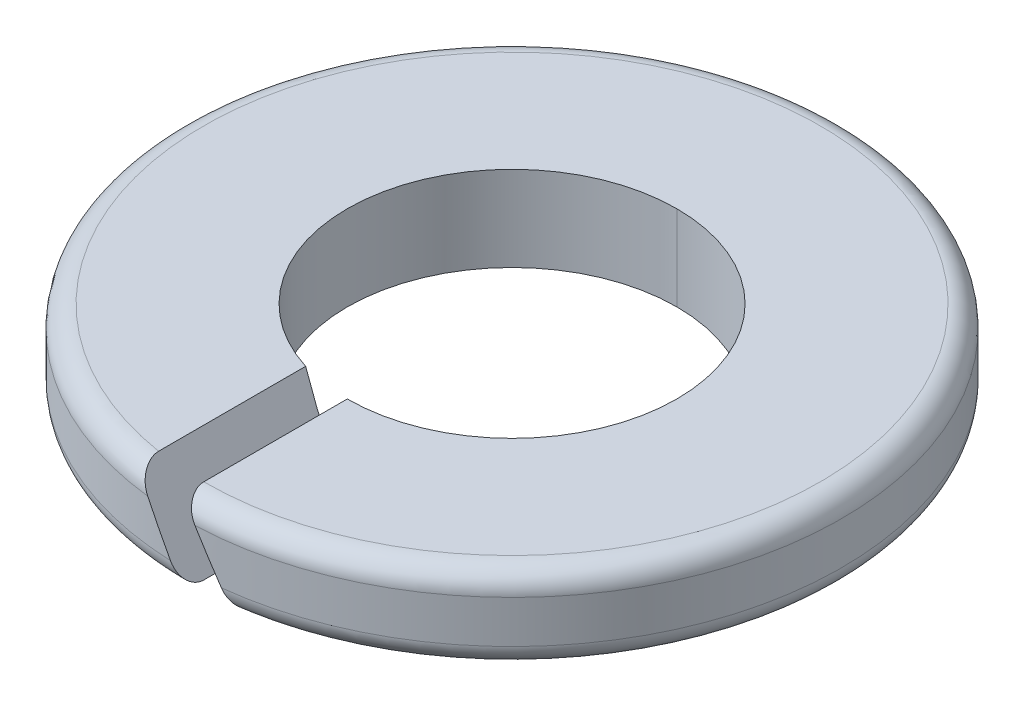
ISO-10303-21;
HEADER;
FILE_DESCRIPTION(('STEP AP214'),'2;1');
FILE_NAME('part.step','',(''),(''),'','','');
FILE_SCHEMA(('AUTOMOTIVE_DESIGN { 1 0 10303 214 1 1 1 1 }'));
ENDSEC;
DATA;
#1=APPLICATION_CONTEXT('core data for automotive mechanical design processes');
#2=APPLICATION_PROTOCOL_DEFINITION('international standard','automotive_design',2000,#1);
#3=PRODUCT_CONTEXT('',#1,'mechanical');
#4=PRODUCT('Part','Part','',(#3));
#5=PRODUCT_RELATED_PRODUCT_CATEGORY('part','',(#4));
#6=PRODUCT_DEFINITION_FORMATION('','',#4);
#7=PRODUCT_DEFINITION_CONTEXT('part definition',#1,'design');
#8=PRODUCT_DEFINITION('design','',#6,#7);
#9=PRODUCT_DEFINITION_SHAPE('','',#8);
#10=(LENGTH_UNIT() NAMED_UNIT(*) SI_UNIT(.MILLI.,.METRE.));
#11=(NAMED_UNIT(*) PLANE_ANGLE_UNIT() SI_UNIT($,.RADIAN.));
#12=(NAMED_UNIT(*) SI_UNIT($,.STERADIAN.) SOLID_ANGLE_UNIT());
#13=UNCERTAINTY_MEASURE_WITH_UNIT(LENGTH_MEASURE(1.E-05),#10,'distance_accuracy_value','');
#14=(GEOMETRIC_REPRESENTATION_CONTEXT(3) GLOBAL_UNCERTAINTY_ASSIGNED_CONTEXT((#13)) GLOBAL_UNIT_ASSIGNED_CONTEXT((#10,
#11,#12)) REPRESENTATION_CONTEXT('',''));
#15=CARTESIAN_POINT('',(0.,0.,0.));
#16=DIRECTION('',(0.,0.,1.));
#17=DIRECTION('',(1.,0.,0.));
#18=AXIS2_PLACEMENT_3D('',#15,#16,#17);
#19=CARTESIAN_POINT('',(0.,0.6,0.));
#20=DIRECTION('',(0.,1.,0.));
#21=DIRECTION('',(0.,0.,1.));
#22=AXIS2_PLACEMENT_3D('',#19,#20,#21);
#23=TOROIDAL_SURFACE('',#22,2.9,0.2);
#24=CARTESIAN_POINT('',(0.115456732515857,0.6,3.09784921242412));
#25=CARTESIAN_POINT('',(0.0704354723741685,0.677988107164708,3.09952715322539));
#26=CARTESIAN_POINT('',(0.0368030310384559,0.73624792554486,3.04618978642237));
#27=CARTESIAN_POINT('',(0.020113865166,0.76515774398296,3.01972259800479));
#28=CARTESIAN_POINT('',(0.0100766260419106,0.782544757984428,2.9812014846878));
#29=CARTESIAN_POINT('',(0.,0.799999999999912,2.94252921148453));
#30=CARTESIAN_POINT('',(0.,0.799999999999912,2.9));
#31=B_SPLINE_CURVE_WITH_KNOTS('',2,(#24,#25,#26,#27,#28,#29,#30),.UNSPECIFIED.,.F.,.F.,(3,2,2,
3),(0.,0.5,0.75,1.),.UNSPECIFIED.);
#32=CARTESIAN_POINT('',(0.115456732515857,0.6,3.09784921242413));
#33=VERTEX_POINT('',#32);
#34=CARTESIAN_POINT('',(0.,0.799999999999912,2.9));
#35=VERTEX_POINT('',#34);
#36=EDGE_CURVE('E41',#33,#35,#31,.T.);
#37=ORIENTED_EDGE('',*,*,#36,.F.);
#38=CARTESIAN_POINT('',(0.,0.6,0.));
#39=DIRECTION('',(0.,-1.,0.));
#40=DIRECTION('',(0.,0.,1.));
#41=AXIS2_PLACEMENT_3D('',#38,#39,#40);
#42=CIRCLE('',#41,3.1);
#43=CARTESIAN_POINT('',(0.,0.6,-3.1));
#44=VERTEX_POINT('',#43);
#45=EDGE_CURVE('E333',#44,#33,#42,.T.);
#46=ORIENTED_EDGE('',*,*,#45,.F.);
#47=CARTESIAN_POINT('',(0.,0.6,0.));
#48=DIRECTION('',(0.,-1.,0.));
#49=DIRECTION('',(0.,0.,1.));
#50=AXIS2_PLACEMENT_3D('',#47,#48,#49);
#51=CIRCLE('',#50,3.1);
#52=CARTESIAN_POINT('',(-0.346370197547841,0.6,3.08058885381524));
#53=VERTEX_POINT('',#52);
#54=EDGE_CURVE('E147',#53,#44,#51,.T.);
#55=ORIENTED_EDGE('',*,*,#54,.F.);
#56=CARTESIAN_POINT('',(-0.461826930063803,0.800000000000022,2.86299072416727));
#57=CARTESIAN_POINT('',(-0.461826930063803,0.800000000000022,2.90535657537502));
#58=CARTESIAN_POINT('',(-0.451763929212738,0.78256836023025,2.94690126208168));
#59=CARTESIAN_POINT('',(-0.44251560680724,0.766547947727721,2.98508258220528));
#60=CARTESIAN_POINT('',(-0.425513024406954,0.737095213305435,3.01574766091442));
#61=CARTESIAN_POINT('',(-0.409817805663643,0.709907160428323,3.04405483842368));
#62=CARTESIAN_POINT('',(-0.388795240661043,0.673490808528365,3.06141017979444));
#63=CARTESIAN_POINT('',(-0.368590326196873,0.638490832305447,3.07809050342999));
#64=CARTESIAN_POINT('',(-0.346370197547842,0.6,3.08058885381524));
#65=B_SPLINE_CURVE_WITH_KNOTS('',2,(#56,#57,#58,#59,#60,#61,#62,#63,#64),.UNSPECIFIED.,.F.,.F.,
(3,2,2,2,3),(0.,0.25,0.5,0.75,1.),.UNSPECIFIED.);
#66=CARTESIAN_POINT('',(-0.461826930063802,0.800000000000023,2.86299072416727));
#67=VERTEX_POINT('',#66);
#68=EDGE_CURVE('E11',#67,#53,#65,.T.);
#69=ORIENTED_EDGE('',*,*,#68,.F.);
#70=CARTESIAN_POINT('',(0.,0.8,0.));
#71=DIRECTION('',(0.,1.,0.));
#72=DIRECTION('',(0.,0.,1.));
#73=AXIS2_PLACEMENT_3D('',#70,#71,#72);
#74=CIRCLE('',#73,2.9);
#75=EDGE_CURVE('E120',#35,#67,#74,.T.);
#76=ORIENTED_EDGE('',*,*,#75,.F.);
#77=EDGE_LOOP('',(#37,#46,#55,#69,#76));
#78=FACE_BOUND('',#77,.T.);
#79=ADVANCED_FACE('F17',(#78),#23,.T.);
#80=CARTESIAN_POINT('',(0.,0.2,0.));
#81=DIRECTION('',(0.,1.,0.));
#82=DIRECTION('',(0.,0.,1.));
#83=AXIS2_PLACEMENT_3D('',#80,#81,#82);
#84=TOROIDAL_SURFACE('',#83,2.9,0.2);
#85=CARTESIAN_POINT('',(0.,0.2,-2.9));
#86=DIRECTION('',(1.,0.,0.));
#87=DIRECTION('',(0.,0.,-1.));
#88=AXIS2_PLACEMENT_3D('',#85,#86,#87);
#89=CIRCLE('',#88,0.2);
#90=CARTESIAN_POINT('',(0.,0.,-2.9));
#91=VERTEX_POINT('',#90);
#92=CARTESIAN_POINT('',(0.,0.2,-3.1));
#93=VERTEX_POINT('',#92);
#94=EDGE_CURVE('E289',#91,#93,#89,.T.);
#95=ORIENTED_EDGE('',*,*,#94,.F.);
#96=CARTESIAN_POINT('',(0.,0.,0.));
#97=DIRECTION('',(0.,-1.,0.));
#98=DIRECTION('',(0.,0.,1.));
#99=AXIS2_PLACEMENT_3D('',#96,#97,#98);
#100=CIRCLE('',#99,2.9);
#101=CARTESIAN_POINT('',(0.,0.,2.9));
#102=VERTEX_POINT('',#101);
#103=EDGE_CURVE('E209',#102,#91,#100,.T.);
#104=ORIENTED_EDGE('',*,*,#103,.F.);
#105=CARTESIAN_POINT('',(-0.11545673251595,0.200000000000004,3.09784921242412));
#106=CARTESIAN_POINT('',(-0.0704354723742432,0.122011892835291,3.09952715322539));
#107=CARTESIAN_POINT('',(-0.0368030310385194,0.0637520744551402,3.04618978642237));
#108=CARTESIAN_POINT('',(-0.0201138651660494,0.0348422560170256,3.01972259800477));
#109=CARTESIAN_POINT('',(-0.0100766260419584,0.0174552420155603,2.9812014846878));
#110=CARTESIAN_POINT('',(0.,0.,2.94252921148436));
#111=CARTESIAN_POINT('',(0.,0.,2.9));
#112=B_SPLINE_CURVE_WITH_KNOTS('',2,(#105,#106,#107,#108,#109,#110,#111),.UNSPECIFIED.,.F.,.F.,
(3,2,2,3),(0.,0.5,0.75,1.),.UNSPECIFIED.);
#113=CARTESIAN_POINT('',(-0.11545673251595,0.200000000000005,3.09784921242412));
#114=VERTEX_POINT('',#113);
#115=EDGE_CURVE('E28',#114,#102,#112,.T.);
#116=ORIENTED_EDGE('',*,*,#115,.F.);
#117=CARTESIAN_POINT('',(0.,0.2,0.));
#118=DIRECTION('',(0.,1.,0.));
#119=DIRECTION('',(0.,0.,1.));
#120=AXIS2_PLACEMENT_3D('',#117,#118,#119);
#121=CIRCLE('',#120,3.1);
#122=EDGE_CURVE('E142',#93,#114,#121,.T.);
#123=ORIENTED_EDGE('',*,*,#122,.F.);
#124=EDGE_LOOP('',(#95,#104,#116,#123));
#125=FACE_BOUND('',#124,.T.);
#126=ADVANCED_FACE('F19',(#125),#84,.T.);
#127=CARTESIAN_POINT('',(0.,0.,3.1));
#128=DIRECTION('',(0.86605038090288,0.499956735866191,0.));
#129=DIRECTION('',(0.,0.,-1.));
#130=AXIS2_PLACEMENT_3D('',#127,#128,#129);
#131=PLANE('',#130);
#132=CARTESIAN_POINT('',(-0.346370197547841,0.6,3.08058885381524));
#133=CARTESIAN_POINT('',(-0.269631931287509,0.467070088355855,3.08921702515045));
#134=CARTESIAN_POINT('',(-0.192624958779882,0.333674710140054,3.09497315531238));
#135=CARTESIAN_POINT('',(-0.11545673251595,0.200000000000005,3.09784921242412));
#136=(BOUNDED_CURVE() B_SPLINE_CURVE(3,(#132,#133,#134,#135),.UNSPECIFIED.,.F.,
.F.) B_SPLINE_CURVE_WITH_KNOTS((4,4),(4.60042286297173,4.67513625737951),
.UNSPECIFIED.) CURVE() GEOMETRIC_REPRESENTATION_ITEM() RATIONAL_B_SPLINE_CURVE((1.,
0.999534879818933,0.999534879818933,1.)) REPRESENTATION_ITEM(''));
#137=EDGE_CURVE('E139',#53,#114,#136,.T.);
#138=ORIENTED_EDGE('',*,*,#137,.T.);
#139=ORIENTED_EDGE('',*,*,#115,.T.);
#140=DIRECTION('',(0.,0.,-1.));
#141=VECTOR('',#140,1.);
#142=CARTESIAN_POINT('',(0.,0.,3.1));
#143=LINE('',#142,#141);
#144=CARTESIAN_POINT('',(0.,0.,1.55));
#145=VERTEX_POINT('',#144);
#146=EDGE_CURVE('E104',#102,#145,#143,.T.);
#147=ORIENTED_EDGE('',*,*,#146,.T.);
#148=CARTESIAN_POINT('',(-0.461826930063802,0.800000000000023,1.47959990763309));
#149=CARTESIAN_POINT('',(-0.312038626680473,0.540529114033906,1.52635327112961));
#150=CARTESIAN_POINT('',(-0.156915304634998,0.271816638520104,1.55));
#151=CARTESIAN_POINT('',(0.,0.,1.55));
#152=(BOUNDED_CURVE() B_SPLINE_CURVE(3,(#148,#149,#150,#151),.UNSPECIFIED.,.F.,
.F.) B_SPLINE_CURVE_WITH_KNOTS((4,4),(4.40984159216447,4.71238898038469),
.UNSPECIFIED.) CURVE() GEOMETRIC_REPRESENTATION_ITEM() RATIONAL_B_SPLINE_CURVE((1.,
0.992386624985624,0.992386624985624,1.)) REPRESENTATION_ITEM(''));
#153=CARTESIAN_POINT('',(-0.461826930063802,0.800000000000023,1.47959990763309));
#154=VERTEX_POINT('',#153);
#155=EDGE_CURVE('E56',#154,#145,#152,.T.);
#156=ORIENTED_EDGE('',*,*,#155,.F.);
#157=DIRECTION('',(0.,0.,-1.));
#158=VECTOR('',#157,1.);
#159=CARTESIAN_POINT('',(-0.461826930063802,0.800000000000023,3.1));
#160=LINE('',#159,#158);
#161=EDGE_CURVE('E101',#67,#154,#160,.T.);
#162=ORIENTED_EDGE('',*,*,#161,.F.);
#163=ORIENTED_EDGE('',*,*,#68,.T.);
#164=EDGE_LOOP('',(#138,#139,#147,#156,#162,#163));
#165=FACE_BOUND('',#164,.T.);
#166=ADVANCED_FACE('F99',(#165),#131,.T.);
#167=CARTESIAN_POINT('',(0.,0.799999999999912,3.1));
#168=DIRECTION('',(-0.866050380902955,-0.499956735866062,0.));
#169=DIRECTION('',(-0.499956735866062,0.866050380902955,0.));
#170=AXIS2_PLACEMENT_3D('',#167,#168,#169);
#171=PLANE('',#170);
#172=DIRECTION('',(0.,0.,-1.));
#173=VECTOR('',#172,1.);
#174=CARTESIAN_POINT('',(0.46182693006358,0.,3.1));
#175=LINE('',#174,#173);
#176=CARTESIAN_POINT('',(0.46182693006358,0.,2.86299072416731));
#177=VERTEX_POINT('',#176);
#178=CARTESIAN_POINT('',(0.46182693006358,0.,1.47959990763316));
#179=VERTEX_POINT('',#178);
#180=EDGE_CURVE('E213',#177,#179,#175,.T.);
#181=ORIENTED_EDGE('',*,*,#180,.F.);
#182=CARTESIAN_POINT('',(0.46182693006358,0.,2.86299072416731));
#183=CARTESIAN_POINT('',(0.46182693006358,0.,2.90535657537506));
#184=CARTESIAN_POINT('',(0.45176392921253,0.0174316397697525,2.9469012620817));
#185=CARTESIAN_POINT('',(0.442515606807055,0.0334520522722469,2.98508258220526));
#186=CARTESIAN_POINT('',(0.425513024406758,0.0629047866945624,3.01574766091444));
#187=CARTESIAN_POINT('',(0.409817805663507,0.0900928395715806,3.04405483842362));
#188=CARTESIAN_POINT('',(0.388795240660859,0.126509191471633,3.06141017979447));
#189=CARTESIAN_POINT('',(0.368590326196744,0.161509167694468,3.07809050343001));
#190=CARTESIAN_POINT('',(0.346370197547672,0.2,3.08058885381526));
#191=B_SPLINE_CURVE_WITH_KNOTS('',2,(#182,#183,#184,#185,#186,#187,#188,#189,#190),
.UNSPECIFIED.,.F.,.F.,(3,2,2,2,3),(0.,0.25,0.5,0.75,1.),.UNSPECIFIED.);
#192=CARTESIAN_POINT('',(0.346370197547672,0.2,3.08058885381526));
#193=VERTEX_POINT('',#192);
#194=EDGE_CURVE('E256',#177,#193,#191,.T.);
#195=ORIENTED_EDGE('',*,*,#194,.T.);
#196=CARTESIAN_POINT('',(0.346370197547672,0.2,3.08058885381526));
#197=CARTESIAN_POINT('',(0.269631931287365,0.332929911644146,3.08921702515046));
#198=CARTESIAN_POINT('',(0.192624958779764,0.466325289859949,3.09497315531239));
#199=CARTESIAN_POINT('',(0.115456732515857,0.6,3.09784921242413));
#200=(BOUNDED_CURVE() B_SPLINE_CURVE(3,(#196,#197,#198,#199),.UNSPECIFIED.,.F.,
.F.) B_SPLINE_CURVE_WITH_KNOTS((4,4),(1.45883020938199,1.53354360378974),
.UNSPECIFIED.) CURVE() GEOMETRIC_REPRESENTATION_ITEM() RATIONAL_B_SPLINE_CURVE((1.,
0.999534879818933,0.999534879818933,1.)) REPRESENTATION_ITEM(''));
#201=EDGE_CURVE('E106',#193,#33,#200,.T.);
#202=ORIENTED_EDGE('',*,*,#201,.T.);
#203=ORIENTED_EDGE('',*,*,#36,.T.);
#204=DIRECTION('',(0.,0.,-1.));
#205=VECTOR('',#204,1.);
#206=CARTESIAN_POINT('',(0.,0.799999999999912,3.1));
#207=LINE('',#206,#205);
#208=CARTESIAN_POINT('',(0.,0.8,1.55));
#209=VERTEX_POINT('',#208);
#210=EDGE_CURVE('E127',#35,#209,#207,.T.);
#211=ORIENTED_EDGE('',*,*,#210,.T.);
#212=CARTESIAN_POINT('',(0.46182693006358,0.,1.47959990763316));
#213=CARTESIAN_POINT('',(0.312038626680306,0.25947088596611,1.52635327112964));
#214=CARTESIAN_POINT('',(0.156915304634894,0.528183361479895,1.55));
#215=CARTESIAN_POINT('',(0.,0.8,1.55));
#216=(BOUNDED_CURVE() B_SPLINE_CURVE(3,(#212,#213,#214,#215),.UNSPECIFIED.,.F.,
.F.) B_SPLINE_CURVE_WITH_KNOTS((4,4),(1.26824893857482,1.57079632679492),
.UNSPECIFIED.) CURVE() GEOMETRIC_REPRESENTATION_ITEM() RATIONAL_B_SPLINE_CURVE((1.,
0.99238662498563,0.99238662498563,1.)) REPRESENTATION_ITEM(''));
#217=EDGE_CURVE('E155',#179,#209,#216,.T.);
#218=ORIENTED_EDGE('',*,*,#217,.F.);
#219=EDGE_LOOP('',(#181,#195,#202,#203,#211,#218));
#220=FACE_BOUND('',#219,.T.);
#221=ADVANCED_FACE('F173',(#220),#171,.T.);
#222=CARTESIAN_POINT('',(0.,0.8,0.));
#223=DIRECTION('',(0.,-1.,0.));
#224=DIRECTION('',(0.,0.,-1.));
#225=AXIS2_PLACEMENT_3D('',#222,#223,#224);
#226=CYLINDRICAL_SURFACE('',#225,1.55);
#227=DIRECTION('',(0.,-1.,0.));
#228=VECTOR('',#227,1.);
#229=CARTESIAN_POINT('',(0.,0.8,-1.55));
#230=LINE('',#229,#228);
#231=CARTESIAN_POINT('',(0.,0.8,-1.55));
#232=VERTEX_POINT('',#231);
#233=CARTESIAN_POINT('',(0.,0.,-1.55));
#234=VERTEX_POINT('',#233);
#235=EDGE_CURVE('E112',#232,#234,#230,.T.);
#236=ORIENTED_EDGE('',*,*,#235,.F.);
#237=CARTESIAN_POINT('',(0.,0.8,0.));
#238=DIRECTION('',(0.,1.,0.));
#239=DIRECTION('',(0.,0.,1.));
#240=AXIS2_PLACEMENT_3D('',#237,#238,#239);
#241=CIRCLE('',#240,1.55);
#242=EDGE_CURVE('E109',#232,#154,#241,.T.);
#243=ORIENTED_EDGE('',*,*,#242,.T.);
#244=ORIENTED_EDGE('',*,*,#155,.T.);
#245=CARTESIAN_POINT('',(0.,0.,0.));
#246=DIRECTION('',(0.,1.,0.));
#247=DIRECTION('',(0.,0.,1.));
#248=AXIS2_PLACEMENT_3D('',#245,#246,#247);
#249=CIRCLE('',#248,1.55);
#250=EDGE_CURVE('E331',#234,#145,#249,.T.);
#251=ORIENTED_EDGE('',*,*,#250,.F.);
#252=EDGE_LOOP('',(#236,#243,#244,#251));
#253=FACE_BOUND('',#252,.T.);
#254=ADVANCED_FACE('F110',(#253),#226,.F.);
#255=CARTESIAN_POINT('',(0.,0.8,0.));
#256=DIRECTION('',(0.,-1.,0.));
#257=DIRECTION('',(0.,0.,-1.));
#258=AXIS2_PLACEMENT_3D('',#255,#256,#257);
#259=CYLINDRICAL_SURFACE('',#258,3.1);
#260=DIRECTION('',(0.,-1.,0.));
#261=VECTOR('',#260,1.);
#262=CARTESIAN_POINT('',(0.,0.8,-3.1));
#263=LINE('',#262,#261);
#264=EDGE_CURVE('E154',#44,#93,#263,.T.);
#265=ORIENTED_EDGE('',*,*,#264,.F.);
#266=ORIENTED_EDGE('',*,*,#45,.T.);
#267=ORIENTED_EDGE('',*,*,#201,.F.);
#268=CARTESIAN_POINT('',(0.,0.2,0.));
#269=DIRECTION('',(0.,1.,0.));
#270=DIRECTION('',(0.,0.,1.));
#271=AXIS2_PLACEMENT_3D('',#268,#269,#270);
#272=CIRCLE('',#271,3.1);
#273=EDGE_CURVE('E293',#193,#93,#272,.T.);
#274=ORIENTED_EDGE('',*,*,#273,.T.);
#275=EDGE_LOOP('',(#265,#266,#267,#274));
#276=FACE_BOUND('',#275,.T.);
#277=ADVANCED_FACE('F497',(#276),#259,.T.);
#278=CARTESIAN_POINT('',(0.,0.,0.));
#279=DIRECTION('',(0.,1.,0.));
#280=DIRECTION('',(1.,0.,0.));
#281=AXIS2_PLACEMENT_3D('',#278,#279,#280);
#282=PLANE('',#281);
#283=ORIENTED_EDGE('',*,*,#146,.F.);
#284=ORIENTED_EDGE('',*,*,#103,.T.);
#285=CARTESIAN_POINT('',(0.,0.,0.));
#286=DIRECTION('',(0.,-1.,0.));
#287=DIRECTION('',(0.,0.,1.));
#288=AXIS2_PLACEMENT_3D('',#285,#286,#287);
#289=CIRCLE('',#288,2.9);
#290=EDGE_CURVE('E294',#91,#177,#289,.T.);
#291=ORIENTED_EDGE('',*,*,#290,.T.);
#292=ORIENTED_EDGE('',*,*,#180,.T.);
#293=CARTESIAN_POINT('',(0.,0.,0.));
#294=DIRECTION('',(0.,1.,0.));
#295=DIRECTION('',(0.,0.,1.));
#296=AXIS2_PLACEMENT_3D('',#293,#294,#295);
#297=CIRCLE('',#296,1.55);
#298=EDGE_CURVE('E320',#179,#234,#297,.T.);
#299=ORIENTED_EDGE('',*,*,#298,.T.);
#300=ORIENTED_EDGE('',*,*,#250,.T.);
#301=EDGE_LOOP('',(#283,#284,#291,#292,#299,#300));
#302=FACE_BOUND('',#301,.T.);
#303=ADVANCED_FACE('F236',(#302),#282,.F.);
#304=CARTESIAN_POINT('',(0.,0.8,0.));
#305=DIRECTION('',(0.,1.,0.));
#306=DIRECTION('',(1.,0.,0.));
#307=AXIS2_PLACEMENT_3D('',#304,#305,#306);
#308=PLANE('',#307);
#309=ORIENTED_EDGE('',*,*,#210,.F.);
#310=ORIENTED_EDGE('',*,*,#75,.T.);
#311=ORIENTED_EDGE('',*,*,#161,.T.);
#312=ORIENTED_EDGE('',*,*,#242,.F.);
#313=CARTESIAN_POINT('',(0.,0.8,0.));
#314=DIRECTION('',(0.,1.,0.));
#315=DIRECTION('',(0.,0.,1.));
#316=AXIS2_PLACEMENT_3D('',#313,#314,#315);
#317=CIRCLE('',#316,1.55);
#318=EDGE_CURVE('E310',#209,#232,#317,.T.);
#319=ORIENTED_EDGE('',*,*,#318,.F.);
#320=EDGE_LOOP('',(#309,#310,#311,#312,#319));
#321=FACE_BOUND('',#320,.T.);
#322=ADVANCED_FACE('F119',(#321),#308,.T.);
#323=CARTESIAN_POINT('',(0.,0.8,0.));
#324=DIRECTION('',(0.,-1.,0.));
#325=DIRECTION('',(0.,0.,-1.));
#326=AXIS2_PLACEMENT_3D('',#323,#324,#325);
#327=CYLINDRICAL_SURFACE('',#326,3.1);
#328=ORIENTED_EDGE('',*,*,#54,.T.);
#329=ORIENTED_EDGE('',*,*,#264,.T.);
#330=ORIENTED_EDGE('',*,*,#122,.T.);
#331=ORIENTED_EDGE('',*,*,#137,.F.);
#332=EDGE_LOOP('',(#328,#329,#330,#331));
#333=FACE_BOUND('',#332,.T.);
#334=ADVANCED_FACE('F189',(#333),#327,.T.);
#335=CARTESIAN_POINT('',(0.,0.8,0.));
#336=DIRECTION('',(0.,-1.,0.));
#337=DIRECTION('',(0.,0.,-1.));
#338=AXIS2_PLACEMENT_3D('',#335,#336,#337);
#339=CYLINDRICAL_SURFACE('',#338,1.55);
#340=ORIENTED_EDGE('',*,*,#318,.T.);
#341=ORIENTED_EDGE('',*,*,#235,.T.);
#342=ORIENTED_EDGE('',*,*,#298,.F.);
#343=ORIENTED_EDGE('',*,*,#217,.T.);
#344=EDGE_LOOP('',(#340,#341,#342,#343));
#345=FACE_BOUND('',#344,.T.);
#346=ADVANCED_FACE('F272',(#345),#339,.F.);
#347=CARTESIAN_POINT('',(0.,0.2,0.));
#348=DIRECTION('',(0.,1.,0.));
#349=DIRECTION('',(0.,0.,1.));
#350=AXIS2_PLACEMENT_3D('',#347,#348,#349);
#351=TOROIDAL_SURFACE('',#350,2.9,0.2);
#352=ORIENTED_EDGE('',*,*,#290,.F.);
#353=ORIENTED_EDGE('',*,*,#94,.T.);
#354=ORIENTED_EDGE('',*,*,#273,.F.);
#355=ORIENTED_EDGE('',*,*,#194,.F.);
#356=EDGE_LOOP('',(#352,#353,#354,#355));
#357=FACE_BOUND('',#356,.T.);
#358=ADVANCED_FACE('F263',(#357),#351,.T.);
#359=CLOSED_SHELL('',(#79,#126,#166,#221,#254,#277,#303,#322,#334,#346,#358));
#360=MANIFOLD_SOLID_BREP('B1',#359);
#361=ADVANCED_BREP_SHAPE_REPRESENTATION('',(#18,#360),#14);
#362=SHAPE_DEFINITION_REPRESENTATION(#9,#361);
ENDSEC;
END-ISO-10303-21;
